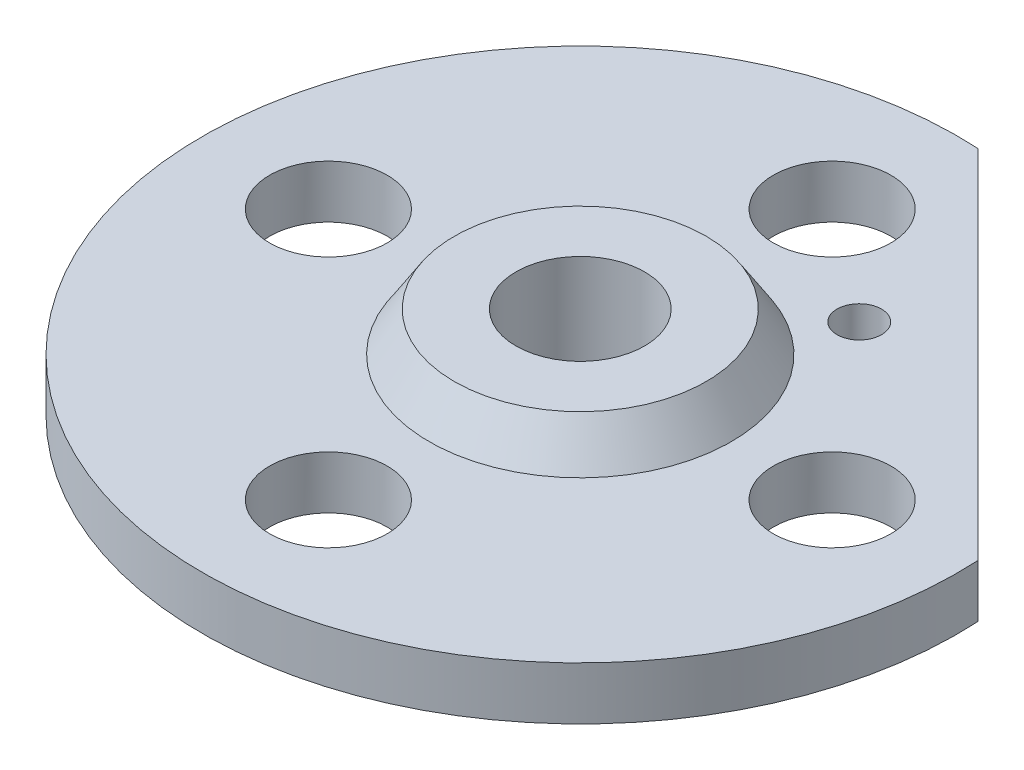
ISO-10303-21;
HEADER;
FILE_DESCRIPTION(('STEP AP214'),'2;1');
FILE_NAME('part.step','',(''),(''),'','','');
FILE_SCHEMA(('AUTOMOTIVE_DESIGN { 1 0 10303 214 1 1 1 1 }'));
ENDSEC;
DATA;
#1=APPLICATION_CONTEXT('core data for automotive mechanical design processes');
#2=APPLICATION_PROTOCOL_DEFINITION('international standard','automotive_design',2000,#1);
#3=PRODUCT_CONTEXT('',#1,'mechanical');
#4=PRODUCT('Part','Part','',(#3));
#5=PRODUCT_RELATED_PRODUCT_CATEGORY('part','',(#4));
#6=PRODUCT_DEFINITION_FORMATION('','',#4);
#7=PRODUCT_DEFINITION_CONTEXT('part definition',#1,'design');
#8=PRODUCT_DEFINITION('design','',#6,#7);
#9=PRODUCT_DEFINITION_SHAPE('','',#8);
#10=(LENGTH_UNIT() NAMED_UNIT(*) SI_UNIT(.MILLI.,.METRE.));
#11=(NAMED_UNIT(*) PLANE_ANGLE_UNIT() SI_UNIT($,.RADIAN.));
#12=(NAMED_UNIT(*) SI_UNIT($,.STERADIAN.) SOLID_ANGLE_UNIT());
#13=UNCERTAINTY_MEASURE_WITH_UNIT(LENGTH_MEASURE(1.E-05),#10,'distance_accuracy_value','');
#14=(GEOMETRIC_REPRESENTATION_CONTEXT(3) GLOBAL_UNCERTAINTY_ASSIGNED_CONTEXT((#13)) GLOBAL_UNIT_ASSIGNED_CONTEXT((#10,
#11,#12)) REPRESENTATION_CONTEXT('',''));
#15=CARTESIAN_POINT('',(0.,0.,0.));
#16=DIRECTION('',(0.,0.,1.));
#17=DIRECTION('',(1.,0.,0.));
#18=AXIS2_PLACEMENT_3D('',#15,#16,#17);
#19=CARTESIAN_POINT('',(0.,0.,0.));
#20=DIRECTION('',(0.,-1.,0.));
#21=DIRECTION('',(0.,0.,-1.));
#22=AXIS2_PLACEMENT_3D('',#19,#20,#21);
#23=PLANE('',#22);
#24=CARTESIAN_POINT('',(0.,0.,0.));
#25=DIRECTION('',(0.,1.,0.));
#26=DIRECTION('',(0.,0.,1.));
#27=AXIS2_PLACEMENT_3D('',#24,#25,#26);
#28=CIRCLE('',#27,7.65809999999999);
#29=CARTESIAN_POINT('',(0.,0.,7.65809999999999));
#30=VERTEX_POINT('',#29);
#31=EDGE_CURVE('E112',#30,#30,#28,.T.);
#32=ORIENTED_EDGE('',*,*,#31,.T.);
#33=EDGE_LOOP('',(#32));
#34=FACE_BOUND('',#33,.T.);
#35=CARTESIAN_POINT('',(0.,0.,0.));
#36=DIRECTION('',(0.,-1.,0.));
#37=DIRECTION('',(0.,0.,-1.));
#38=AXIS2_PLACEMENT_3D('',#35,#36,#37);
#39=CIRCLE('',#38,20.);
#40=CARTESIAN_POINT('',(0.,0.,-20.));
#41=VERTEX_POINT('',#40);
#42=EDGE_CURVE('E81',#41,#41,#39,.T.);
#43=ORIENTED_EDGE('',*,*,#42,.T.);
#44=EDGE_LOOP('',(#43));
#45=FACE_BOUND('',#44,.T.);
#46=ADVANCED_FACE('F34',(#34,#45),#23,.T.);
#47=CARTESIAN_POINT('',(15.,12.,0.));
#48=DIRECTION('',(0.,1.,0.));
#49=DIRECTION('',(0.,0.,1.));
#50=AXIS2_PLACEMENT_3D('',#47,#48,#49);
#51=PLANE('',#50);
#52=CARTESIAN_POINT('',(0.,12.,0.));
#53=DIRECTION('',(0.,1.,0.));
#54=DIRECTION('',(0.,0.,1.));
#55=AXIS2_PLACEMENT_3D('',#52,#53,#54);
#56=CIRCLE('',#55,7.6581);
#57=CARTESIAN_POINT('',(0.,12.,7.6581));
#58=VERTEX_POINT('',#57);
#59=EDGE_CURVE('E73',#58,#58,#56,.T.);
#60=ORIENTED_EDGE('',*,*,#59,.F.);
#61=EDGE_LOOP('',(#60));
#62=FACE_BOUND('',#61,.T.);
#63=CARTESIAN_POINT('',(0.,12.,0.));
#64=DIRECTION('',(0.,-1.,0.));
#65=DIRECTION('',(0.,0.,-1.));
#66=AXIS2_PLACEMENT_3D('',#63,#64,#65);
#67=CIRCLE('',#66,15.);
#68=CARTESIAN_POINT('',(0.,12.,-15.));
#69=VERTEX_POINT('',#68);
#70=EDGE_CURVE('E11',#69,#69,#67,.T.);
#71=ORIENTED_EDGE('',*,*,#70,.F.);
#72=EDGE_LOOP('',(#71));
#73=FACE_BOUND('',#72,.T.);
#74=ADVANCED_FACE('F144',(#62,#73),#51,.T.);
#75=CARTESIAN_POINT('',(0.,7.3,0.));
#76=DIRECTION('',(0.,-1.,0.));
#77=DIRECTION('',(0.,0.,-1.));
#78=AXIS2_PLACEMENT_3D('',#75,#76,#77);
#79=CONICAL_SURFACE('',#78,18.,0.568104732474427);
#80=ORIENTED_EDGE('',*,*,#70,.T.);
#81=EDGE_LOOP('',(#80));
#82=FACE_BOUND('',#81,.T.);
#83=CARTESIAN_POINT('',(0.,7.3,0.));
#84=DIRECTION('',(0.,-1.,0.));
#85=DIRECTION('',(0.,0.,-1.));
#86=AXIS2_PLACEMENT_3D('',#83,#84,#85);
#87=CIRCLE('',#86,18.);
#88=CARTESIAN_POINT('',(0.,7.3,-18.));
#89=VERTEX_POINT('',#88);
#90=EDGE_CURVE('E42',#89,#89,#87,.T.);
#91=ORIENTED_EDGE('',*,*,#90,.F.);
#92=EDGE_LOOP('',(#91));
#93=FACE_BOUND('',#92,.T.);
#94=ADVANCED_FACE('F131',(#82,#93),#79,.T.);
#95=CARTESIAN_POINT('',(18.,7.3,0.));
#96=DIRECTION('',(0.,1.,0.));
#97=DIRECTION('',(0.,0.,1.));
#98=AXIS2_PLACEMENT_3D('',#95,#96,#97);
#99=PLANE('',#98);
#100=CARTESIAN_POINT('',(13.2552811498224,7.3,-19.9787375659453));
#101=DIRECTION('',(0.,1.,0.));
#102=DIRECTION('',(0.,0.,1.));
#103=AXIS2_PLACEMENT_3D('',#100,#101,#102);
#104=CIRCLE('',#103,2.64999999999999);
#105=CARTESIAN_POINT('',(13.2552811498224,7.3,-17.3287375659453));
#106=VERTEX_POINT('',#105);
#107=EDGE_CURVE('E122',#106,#106,#104,.T.);
#108=ORIENTED_EDGE('',*,*,#107,.F.);
#109=EDGE_LOOP('',(#108));
#110=FACE_BOUND('',#109,.T.);
#111=DIRECTION('',(0.707106781186548,0.,0.707106781186547));
#112=VECTOR('',#111,1.);
#113=CARTESIAN_POINT('',(44.9336649469797,7.3,-2.44248939251893));
#114=LINE('',#113,#112);
#115=CARTESIAN_POINT('',(2.44248939251892,7.3,-44.9336649469797));
#116=VERTEX_POINT('',#115);
#117=CARTESIAN_POINT('',(44.9336649469797,7.3,-2.44248939251893));
#118=VERTEX_POINT('',#117);
#119=EDGE_CURVE('E65',#116,#118,#114,.T.);
#120=ORIENTED_EDGE('',*,*,#119,.F.);
#121=CARTESIAN_POINT('',(0.,7.3,0.));
#122=DIRECTION('',(0.,-1.,0.));
#123=DIRECTION('',(0.,0.,-1.));
#124=AXIS2_PLACEMENT_3D('',#121,#122,#123);
#125=CIRCLE('',#124,45.);
#126=EDGE_CURVE('E72',#118,#116,#125,.T.);
#127=ORIENTED_EDGE('',*,*,#126,.F.);
#128=EDGE_LOOP('',(#120,#127));
#129=FACE_BOUND('',#128,.T.);
#130=CARTESIAN_POINT('',(-30.,7.3,-3.14233320495882E-13));
#131=DIRECTION('',(0.,1.,0.));
#132=DIRECTION('',(0.,0.,1.));
#133=AXIS2_PLACEMENT_3D('',#130,#131,#132);
#134=CIRCLE('',#133,6.99999999999999);
#135=CARTESIAN_POINT('',(-30.,7.3,6.99999999999967));
#136=VERTEX_POINT('',#135);
#137=EDGE_CURVE('E109',#136,#136,#134,.T.);
#138=ORIENTED_EDGE('',*,*,#137,.F.);
#139=EDGE_LOOP('',(#138));
#140=FACE_BOUND('',#139,.T.);
#141=CARTESIAN_POINT('',(0.,7.3,30.));
#142=DIRECTION('',(0.,1.,0.));
#143=DIRECTION('',(0.,0.,1.));
#144=AXIS2_PLACEMENT_3D('',#141,#142,#143);
#145=CIRCLE('',#144,6.99999999999999);
#146=CARTESIAN_POINT('',(0.,7.3,37.));
#147=VERTEX_POINT('',#146);
#148=EDGE_CURVE('E106',#147,#147,#145,.T.);
#149=ORIENTED_EDGE('',*,*,#148,.F.);
#150=EDGE_LOOP('',(#149));
#151=FACE_BOUND('',#150,.T.);
#152=CARTESIAN_POINT('',(30.,7.3,1.04744440165294E-13));
#153=DIRECTION('',(0.,1.,0.));
#154=DIRECTION('',(0.,0.,1.));
#155=AXIS2_PLACEMENT_3D('',#152,#153,#154);
#156=CIRCLE('',#155,6.99999999999999);
#157=CARTESIAN_POINT('',(30.,7.3,7.00000000000009));
#158=VERTEX_POINT('',#157);
#159=EDGE_CURVE('E98',#158,#158,#156,.T.);
#160=ORIENTED_EDGE('',*,*,#159,.F.);
#161=EDGE_LOOP('',(#160));
#162=FACE_BOUND('',#161,.T.);
#163=CARTESIAN_POINT('',(0.,7.3,-30.));
#164=DIRECTION('',(0.,1.,0.));
#165=DIRECTION('',(0.,0.,1.));
#166=AXIS2_PLACEMENT_3D('',#163,#164,#165);
#167=CIRCLE('',#166,6.99999999999999);
#168=CARTESIAN_POINT('',(0.,7.3,-23.));
#169=VERTEX_POINT('',#168);
#170=EDGE_CURVE('E88',#169,#169,#167,.T.);
#171=ORIENTED_EDGE('',*,*,#170,.F.);
#172=EDGE_LOOP('',(#171));
#173=FACE_BOUND('',#172,.T.);
#174=ORIENTED_EDGE('',*,*,#90,.T.);
#175=EDGE_LOOP('',(#174));
#176=FACE_BOUND('',#175,.T.);
#177=ADVANCED_FACE('F128',(#110,#129,#140,#151,#162,#173,#176),#99,.T.);
#178=CARTESIAN_POINT('',(0.,0.,0.));
#179=DIRECTION('',(0.,-1.,0.));
#180=DIRECTION('',(0.,0.,-1.));
#181=AXIS2_PLACEMENT_3D('',#178,#179,#180);
#182=CYLINDRICAL_SURFACE('',#181,45.);
#183=DIRECTION('',(0.,1.,0.));
#184=VECTOR('',#183,1.);
#185=CARTESIAN_POINT('',(2.44248939251892,-59.0915967502946,-44.9336649469797));
#186=LINE('',#185,#184);
#187=CARTESIAN_POINT('',(2.44248939251892,1.,-44.9336649469797));
#188=VERTEX_POINT('',#187);
#189=EDGE_CURVE('E56',#188,#116,#186,.T.);
#190=ORIENTED_EDGE('',*,*,#189,.F.);
#191=CARTESIAN_POINT('',(0.,1.,0.));
#192=DIRECTION('',(0.,-1.,0.));
#193=DIRECTION('',(0.,0.,-1.));
#194=AXIS2_PLACEMENT_3D('',#191,#192,#193);
#195=CIRCLE('',#194,45.);
#196=CARTESIAN_POINT('',(44.9336649469797,1.,-2.44248939251893));
#197=VERTEX_POINT('',#196);
#198=EDGE_CURVE('E70',#197,#188,#195,.T.);
#199=ORIENTED_EDGE('',*,*,#198,.F.);
#200=DIRECTION('',(0.,1.,0.));
#201=VECTOR('',#200,1.);
#202=CARTESIAN_POINT('',(44.9336649469797,-59.0915967502946,-2.44248939251893));
#203=LINE('',#202,#201);
#204=EDGE_CURVE('E50',#197,#118,#203,.T.);
#205=ORIENTED_EDGE('',*,*,#204,.T.);
#206=ORIENTED_EDGE('',*,*,#126,.T.);
#207=EDGE_LOOP('',(#190,#199,#205,#206));
#208=FACE_BOUND('',#207,.T.);
#209=ADVANCED_FACE('F69',(#208),#182,.T.);
#210=CARTESIAN_POINT('',(45.,0.999999999999999,0.));
#211=DIRECTION('',(0.,-1.,0.));
#212=DIRECTION('',(0.,0.,-1.));
#213=AXIS2_PLACEMENT_3D('',#210,#211,#212);
#214=PLANE('',#213);
#215=CARTESIAN_POINT('',(13.2552811498224,0.999999999999998,-19.9787375659453));
#216=DIRECTION('',(0.,-1.,0.));
#217=DIRECTION('',(0.,0.,-1.));
#218=AXIS2_PLACEMENT_3D('',#215,#216,#217);
#219=CIRCLE('',#218,2.64999999999999);
#220=CARTESIAN_POINT('',(13.2552811498224,0.999999999999998,-22.6287375659453));
#221=VERTEX_POINT('',#220);
#222=EDGE_CURVE('E119',#221,#221,#219,.T.);
#223=ORIENTED_EDGE('',*,*,#222,.F.);
#224=EDGE_LOOP('',(#223));
#225=FACE_BOUND('',#224,.T.);
#226=DIRECTION('',(0.707106781186548,0.,0.707106781186547));
#227=VECTOR('',#226,1.);
#228=CARTESIAN_POINT('',(44.9336649469797,1.,-2.44248939251893));
#229=LINE('',#228,#227);
#230=EDGE_CURVE('E60',#188,#197,#229,.T.);
#231=ORIENTED_EDGE('',*,*,#230,.T.);
#232=ORIENTED_EDGE('',*,*,#198,.T.);
#233=EDGE_LOOP('',(#231,#232));
#234=FACE_BOUND('',#233,.T.);
#235=CARTESIAN_POINT('',(-30.,0.999999999999998,-3.14233320495882E-13));
#236=DIRECTION('',(0.,-1.,0.));
#237=DIRECTION('',(0.,0.,-1.));
#238=AXIS2_PLACEMENT_3D('',#235,#236,#237);
#239=CIRCLE('',#238,6.99999999999999);
#240=CARTESIAN_POINT('',(-30.,0.999999999999998,-7.00000000000031));
#241=VERTEX_POINT('',#240);
#242=EDGE_CURVE('E37',#241,#241,#239,.T.);
#243=ORIENTED_EDGE('',*,*,#242,.F.);
#244=EDGE_LOOP('',(#243));
#245=FACE_BOUND('',#244,.T.);
#246=CARTESIAN_POINT('',(0.,0.999999999999998,30.));
#247=DIRECTION('',(0.,-1.,0.));
#248=DIRECTION('',(0.,0.,-1.));
#249=AXIS2_PLACEMENT_3D('',#246,#247,#248);
#250=CIRCLE('',#249,6.99999999999999);
#251=CARTESIAN_POINT('',(0.,0.999999999999998,23.));
#252=VERTEX_POINT('',#251);
#253=EDGE_CURVE('E103',#252,#252,#250,.T.);
#254=ORIENTED_EDGE('',*,*,#253,.F.);
#255=EDGE_LOOP('',(#254));
#256=FACE_BOUND('',#255,.T.);
#257=CARTESIAN_POINT('',(30.,0.999999999999998,1.04744440165294E-13));
#258=DIRECTION('',(0.,-1.,0.));
#259=DIRECTION('',(0.,0.,-1.));
#260=AXIS2_PLACEMENT_3D('',#257,#258,#259);
#261=CIRCLE('',#260,6.99999999999999);
#262=CARTESIAN_POINT('',(30.,0.999999999999998,-6.99999999999989));
#263=VERTEX_POINT('',#262);
#264=EDGE_CURVE('E93',#263,#263,#261,.T.);
#265=ORIENTED_EDGE('',*,*,#264,.F.);
#266=EDGE_LOOP('',(#265));
#267=FACE_BOUND('',#266,.T.);
#268=CARTESIAN_POINT('',(0.,0.999999999999998,-30.));
#269=DIRECTION('',(0.,-1.,0.));
#270=DIRECTION('',(0.,0.,-1.));
#271=AXIS2_PLACEMENT_3D('',#268,#269,#270);
#272=CIRCLE('',#271,6.99999999999999);
#273=CARTESIAN_POINT('',(0.,0.999999999999998,-37.));
#274=VERTEX_POINT('',#273);
#275=EDGE_CURVE('E86',#274,#274,#272,.T.);
#276=ORIENTED_EDGE('',*,*,#275,.F.);
#277=EDGE_LOOP('',(#276));
#278=FACE_BOUND('',#277,.T.);
#279=CARTESIAN_POINT('',(0.,0.999999999999997,0.));
#280=DIRECTION('',(0.,-1.,0.));
#281=DIRECTION('',(0.,0.,-1.));
#282=AXIS2_PLACEMENT_3D('',#279,#280,#281);
#283=CIRCLE('',#282,21.);
#284=CARTESIAN_POINT('',(0.,0.999999999999997,-21.));
#285=VERTEX_POINT('',#284);
#286=EDGE_CURVE('E77',#285,#285,#283,.T.);
#287=ORIENTED_EDGE('',*,*,#286,.F.);
#288=EDGE_LOOP('',(#287));
#289=FACE_BOUND('',#288,.T.);
#290=ADVANCED_FACE('F75',(#225,#234,#245,#256,#267,#278,#289),#214,.T.);
#291=CARTESIAN_POINT('',(0.,0.,0.));
#292=DIRECTION('',(0.,1.,0.));
#293=DIRECTION('',(0.,0.,1.));
#294=AXIS2_PLACEMENT_3D('',#291,#292,#293);
#295=CONICAL_SURFACE('',#294,20.,0.785398163397448);
#296=ORIENTED_EDGE('',*,*,#286,.T.);
#297=EDGE_LOOP('',(#296));
#298=FACE_BOUND('',#297,.T.);
#299=ORIENTED_EDGE('',*,*,#42,.F.);
#300=EDGE_LOOP('',(#299));
#301=FACE_BOUND('',#300,.T.);
#302=ADVANCED_FACE('F159',(#298,#301),#295,.T.);
#303=CARTESIAN_POINT('',(0.,7.3,-30.));
#304=DIRECTION('',(0.,1.,0.));
#305=DIRECTION('',(0.,0.,1.));
#306=AXIS2_PLACEMENT_3D('',#303,#304,#305);
#307=CYLINDRICAL_SURFACE('',#306,6.99999999999999);
#308=ORIENTED_EDGE('',*,*,#275,.T.);
#309=EDGE_LOOP('',(#308));
#310=FACE_BOUND('',#309,.T.);
#311=ORIENTED_EDGE('',*,*,#170,.T.);
#312=EDGE_LOOP('',(#311));
#313=FACE_BOUND('',#312,.T.);
#314=ADVANCED_FACE('F161',(#310,#313),#307,.F.);
#315=CARTESIAN_POINT('',(30.,7.3,1.04744440165294E-13));
#316=DIRECTION('',(0.,1.,0.));
#317=DIRECTION('',(0.,0.,1.));
#318=AXIS2_PLACEMENT_3D('',#315,#316,#317);
#319=CYLINDRICAL_SURFACE('',#318,6.99999999999999);
#320=ORIENTED_EDGE('',*,*,#264,.T.);
#321=EDGE_LOOP('',(#320));
#322=FACE_BOUND('',#321,.T.);
#323=ORIENTED_EDGE('',*,*,#159,.T.);
#324=EDGE_LOOP('',(#323));
#325=FACE_BOUND('',#324,.T.);
#326=ADVANCED_FACE('F168',(#322,#325),#319,.F.);
#327=CARTESIAN_POINT('',(0.,7.3,30.));
#328=DIRECTION('',(0.,1.,0.));
#329=DIRECTION('',(0.,0.,1.));
#330=AXIS2_PLACEMENT_3D('',#327,#328,#329);
#331=CYLINDRICAL_SURFACE('',#330,6.99999999999999);
#332=ORIENTED_EDGE('',*,*,#253,.T.);
#333=EDGE_LOOP('',(#332));
#334=FACE_BOUND('',#333,.T.);
#335=ORIENTED_EDGE('',*,*,#148,.T.);
#336=EDGE_LOOP('',(#335));
#337=FACE_BOUND('',#336,.T.);
#338=ADVANCED_FACE('F218',(#334,#337),#331,.F.);
#339=CARTESIAN_POINT('',(-30.,7.3,-3.14233320495882E-13));
#340=DIRECTION('',(0.,1.,0.));
#341=DIRECTION('',(0.,0.,1.));
#342=AXIS2_PLACEMENT_3D('',#339,#340,#341);
#343=CYLINDRICAL_SURFACE('',#342,6.99999999999999);
#344=ORIENTED_EDGE('',*,*,#242,.T.);
#345=EDGE_LOOP('',(#344));
#346=FACE_BOUND('',#345,.T.);
#347=ORIENTED_EDGE('',*,*,#137,.T.);
#348=EDGE_LOOP('',(#347));
#349=FACE_BOUND('',#348,.T.);
#350=ADVANCED_FACE('F211',(#346,#349),#343,.F.);
#351=CARTESIAN_POINT('',(0.,12.,0.));
#352=DIRECTION('',(0.,1.,0.));
#353=DIRECTION('',(0.,0.,1.));
#354=AXIS2_PLACEMENT_3D('',#351,#352,#353);
#355=CYLINDRICAL_SURFACE('',#354,7.6581);
#356=ORIENTED_EDGE('',*,*,#31,.F.);
#357=EDGE_LOOP('',(#356));
#358=FACE_BOUND('',#357,.T.);
#359=ORIENTED_EDGE('',*,*,#59,.T.);
#360=EDGE_LOOP('',(#359));
#361=FACE_BOUND('',#360,.T.);
#362=ADVANCED_FACE('F205',(#358,#361),#355,.F.);
#363=CARTESIAN_POINT('',(44.9336649469797,-59.0915967502946,-2.44248939251893));
#364=DIRECTION('',(-0.707106781186547,0.,0.707106781186548));
#365=DIRECTION('',(0.707106781186548,0.,0.707106781186547));
#366=AXIS2_PLACEMENT_3D('',#363,#364,#365);
#367=PLANE('',#366);
#368=ORIENTED_EDGE('',*,*,#189,.T.);
#369=ORIENTED_EDGE('',*,*,#119,.T.);
#370=ORIENTED_EDGE('',*,*,#204,.F.);
#371=ORIENTED_EDGE('',*,*,#230,.F.);
#372=EDGE_LOOP('',(#368,#369,#370,#371));
#373=FACE_BOUND('',#372,.T.);
#374=ADVANCED_FACE('F61',(#373),#367,.F.);
#375=CARTESIAN_POINT('',(13.2552811498224,7.3,-19.9787375659453));
#376=DIRECTION('',(0.,1.,0.));
#377=DIRECTION('',(0.,0.,1.));
#378=AXIS2_PLACEMENT_3D('',#375,#376,#377);
#379=CYLINDRICAL_SURFACE('',#378,2.64999999999999);
#380=ORIENTED_EDGE('',*,*,#222,.T.);
#381=EDGE_LOOP('',(#380));
#382=FACE_BOUND('',#381,.T.);
#383=ORIENTED_EDGE('',*,*,#107,.T.);
#384=EDGE_LOOP('',(#383));
#385=FACE_BOUND('',#384,.T.);
#386=ADVANCED_FACE('F126',(#382,#385),#379,.F.);
#387=CLOSED_SHELL('',(#46,#74,#94,#177,#209,#290,#302,#314,#326,#338,#350,#362,#374,#386));
#388=MANIFOLD_SOLID_BREP('B2',#387);
#389=ADVANCED_BREP_SHAPE_REPRESENTATION('',(#18,#388),#14);
#390=SHAPE_DEFINITION_REPRESENTATION(#9,#389);
ENDSEC;
END-ISO-10303-21;
